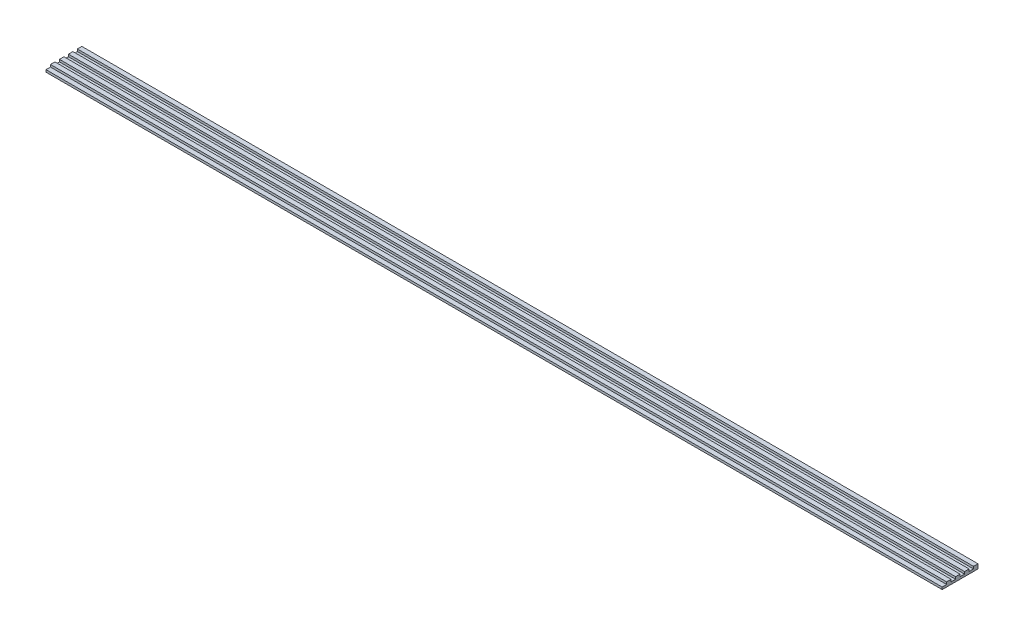
ISO-10303-21;
HEADER;
FILE_DESCRIPTION(('STEP AP214'),'2;1');
FILE_NAME('part.step','',(''),(''),'','','');
FILE_SCHEMA(('AUTOMOTIVE_DESIGN { 1 0 10303 214 1 1 1 1 }'));
ENDSEC;
DATA;
#1=APPLICATION_CONTEXT('core data for automotive mechanical design processes');
#2=APPLICATION_PROTOCOL_DEFINITION('international standard','automotive_design',2000,#1);
#3=PRODUCT_CONTEXT('',#1,'mechanical');
#4=PRODUCT('Part','Part','',(#3));
#5=PRODUCT_RELATED_PRODUCT_CATEGORY('part','',(#4));
#6=PRODUCT_DEFINITION_FORMATION('','',#4);
#7=PRODUCT_DEFINITION_CONTEXT('part definition',#1,'design');
#8=PRODUCT_DEFINITION('design','',#6,#7);
#9=PRODUCT_DEFINITION_SHAPE('','',#8);
#10=(LENGTH_UNIT() NAMED_UNIT(*) SI_UNIT(.MILLI.,.METRE.));
#11=(NAMED_UNIT(*) PLANE_ANGLE_UNIT() SI_UNIT($,.RADIAN.));
#12=(NAMED_UNIT(*) SI_UNIT($,.STERADIAN.) SOLID_ANGLE_UNIT());
#13=UNCERTAINTY_MEASURE_WITH_UNIT(LENGTH_MEASURE(1.E-05),#10,'distance_accuracy_value','');
#14=(GEOMETRIC_REPRESENTATION_CONTEXT(3) GLOBAL_UNCERTAINTY_ASSIGNED_CONTEXT((#13)) GLOBAL_UNIT_ASSIGNED_CONTEXT((#10,
#11,#12)) REPRESENTATION_CONTEXT('',''));
#15=CARTESIAN_POINT('',(0.,0.,0.));
#16=DIRECTION('',(0.,0.,1.));
#17=DIRECTION('',(1.,0.,0.));
#18=AXIS2_PLACEMENT_3D('',#15,#16,#17);
#19=CARTESIAN_POINT('',(0.,0.5,0.));
#20=DIRECTION('',(0.,1.,0.));
#21=DIRECTION('',(0.,0.,1.));
#22=AXIS2_PLACEMENT_3D('',#19,#20,#21);
#23=PLANE('',#22);
#24=DIRECTION('',(0.,0.,1.));
#25=VECTOR('',#24,1.);
#26=CARTESIAN_POINT('',(-100.,0.5,-4.));
#27=LINE('',#26,#25);
#28=CARTESIAN_POINT('',(-100.,0.5,0.999999999999999));
#29=VERTEX_POINT('',#28);
#30=CARTESIAN_POINT('',(-100.,0.5,2.));
#31=VERTEX_POINT('',#30);
#32=EDGE_CURVE('E365',#29,#31,#27,.T.);
#33=ORIENTED_EDGE('',*,*,#32,.T.);
#34=DIRECTION('',(-1.,0.,0.));
#35=VECTOR('',#34,1.);
#36=CARTESIAN_POINT('',(-99.9999999999999,0.5,2.));
#37=LINE('',#36,#35);
#38=CARTESIAN_POINT('',(100.,0.5,2.));
#39=VERTEX_POINT('',#38);
#40=EDGE_CURVE('E55',#39,#31,#37,.T.);
#41=ORIENTED_EDGE('',*,*,#40,.F.);
#42=DIRECTION('',(0.,0.,-1.));
#43=VECTOR('',#42,1.);
#44=CARTESIAN_POINT('',(100.,0.5,-4.));
#45=LINE('',#44,#43);
#46=CARTESIAN_POINT('',(100.,0.5,0.999999999999999));
#47=VERTEX_POINT('',#46);
#48=EDGE_CURVE('E302',#39,#47,#45,.T.);
#49=ORIENTED_EDGE('',*,*,#48,.T.);
#50=DIRECTION('',(1.,0.,0.));
#51=VECTOR('',#50,1.);
#52=CARTESIAN_POINT('',(-100.,0.5,0.999999999999999));
#53=LINE('',#52,#51);
#54=EDGE_CURVE('E196',#29,#47,#53,.T.);
#55=ORIENTED_EDGE('',*,*,#54,.F.);
#56=EDGE_LOOP('',(#33,#41,#49,#55));
#57=FACE_BOUND('',#56,.T.);
#58=ADVANCED_FACE('F39',(#57),#23,.T.);
#59=CARTESIAN_POINT('',(100.,0.5,4.));
#60=VERTEX_POINT('',#59);
#61=CARTESIAN_POINT('',(100.,0.5,3.));
#62=VERTEX_POINT('',#61);
#63=EDGE_CURVE('E63',#60,#62,#45,.T.);
#64=ORIENTED_EDGE('',*,*,#63,.T.);
#65=DIRECTION('',(1.,0.,0.));
#66=VECTOR('',#65,1.);
#67=CARTESIAN_POINT('',(-99.9999999999999,0.5,3.));
#68=LINE('',#67,#66);
#69=CARTESIAN_POINT('',(-99.9999999999999,0.5,3.));
#70=VERTEX_POINT('',#69);
#71=EDGE_CURVE('E187',#70,#62,#68,.T.);
#72=ORIENTED_EDGE('',*,*,#71,.F.);
#73=CARTESIAN_POINT('',(-100.,0.5,4.));
#74=VERTEX_POINT('',#73);
#75=EDGE_CURVE('E301',#70,#74,#27,.T.);
#76=ORIENTED_EDGE('',*,*,#75,.T.);
#77=DIRECTION('',(1.,0.,0.));
#78=VECTOR('',#77,1.);
#79=CARTESIAN_POINT('',(-100.,0.5,4.));
#80=LINE('',#79,#78);
#81=EDGE_CURVE('E307',#74,#60,#80,.T.);
#82=ORIENTED_EDGE('',*,*,#81,.T.);
#83=EDGE_LOOP('',(#64,#72,#76,#82));
#84=FACE_BOUND('',#83,.T.);
#85=ADVANCED_FACE('F363',(#84),#23,.T.);
#86=CARTESIAN_POINT('',(-100.,0.5,-1.));
#87=VERTEX_POINT('',#86);
#88=CARTESIAN_POINT('',(-100.,0.5,0.));
#89=VERTEX_POINT('',#88);
#90=EDGE_CURVE('E308',#87,#89,#27,.T.);
#91=ORIENTED_EDGE('',*,*,#90,.T.);
#92=DIRECTION('',(-1.,0.,0.));
#93=VECTOR('',#92,1.);
#94=CARTESIAN_POINT('',(-100.,0.5,0.));
#95=LINE('',#94,#93);
#96=CARTESIAN_POINT('',(100.,0.5,0.));
#97=VERTEX_POINT('',#96);
#98=EDGE_CURVE('E191',#97,#89,#95,.T.);
#99=ORIENTED_EDGE('',*,*,#98,.F.);
#100=CARTESIAN_POINT('',(100.,0.5,-1.));
#101=VERTEX_POINT('',#100);
#102=EDGE_CURVE('E381',#97,#101,#45,.T.);
#103=ORIENTED_EDGE('',*,*,#102,.T.);
#104=DIRECTION('',(1.,0.,0.));
#105=VECTOR('',#104,1.);
#106=CARTESIAN_POINT('',(-100.,0.5,-1.));
#107=LINE('',#106,#105);
#108=EDGE_CURVE('E240',#87,#101,#107,.T.);
#109=ORIENTED_EDGE('',*,*,#108,.F.);
#110=EDGE_LOOP('',(#91,#99,#103,#109));
#111=FACE_BOUND('',#110,.T.);
#112=ADVANCED_FACE('F371',(#111),#23,.T.);
#113=CARTESIAN_POINT('',(-100.,0.5,-3.));
#114=VERTEX_POINT('',#113);
#115=CARTESIAN_POINT('',(-100.,0.5,-2.));
#116=VERTEX_POINT('',#115);
#117=EDGE_CURVE('E304',#114,#116,#27,.T.);
#118=ORIENTED_EDGE('',*,*,#117,.T.);
#119=DIRECTION('',(-1.,0.,0.));
#120=VECTOR('',#119,1.);
#121=CARTESIAN_POINT('',(-100.,0.5,-2.));
#122=LINE('',#121,#120);
#123=CARTESIAN_POINT('',(100.,0.5,-2.));
#124=VERTEX_POINT('',#123);
#125=EDGE_CURVE('E234',#124,#116,#122,.T.);
#126=ORIENTED_EDGE('',*,*,#125,.F.);
#127=CARTESIAN_POINT('',(100.,0.5,-3.));
#128=VERTEX_POINT('',#127);
#129=EDGE_CURVE('E303',#124,#128,#45,.T.);
#130=ORIENTED_EDGE('',*,*,#129,.T.);
#131=DIRECTION('',(1.,0.,0.));
#132=VECTOR('',#131,1.);
#133=CARTESIAN_POINT('',(-100.,0.5,-3.));
#134=LINE('',#133,#132);
#135=EDGE_CURVE('E271',#114,#128,#134,.T.);
#136=ORIENTED_EDGE('',*,*,#135,.F.);
#137=EDGE_LOOP('',(#118,#126,#130,#136));
#138=FACE_BOUND('',#137,.T.);
#139=ADVANCED_FACE('F389',(#138),#23,.T.);
#140=CARTESIAN_POINT('',(100.,0.5,-4.));
#141=DIRECTION('',(-1.,0.,0.));
#142=DIRECTION('',(0.,0.,1.));
#143=AXIS2_PLACEMENT_3D('',#140,#141,#142);
#144=PLANE('',#143);
#145=DIRECTION('',(0.,0.,-1.));
#146=VECTOR('',#145,1.);
#147=CARTESIAN_POINT('',(100.,0.,-4.));
#148=LINE('',#147,#146);
#149=CARTESIAN_POINT('',(100.,0.,4.));
#150=VERTEX_POINT('',#149);
#151=CARTESIAN_POINT('',(100.,0.,-4.));
#152=VERTEX_POINT('',#151);
#153=EDGE_CURVE('E298',#150,#152,#148,.T.);
#154=ORIENTED_EDGE('',*,*,#153,.T.);
#155=DIRECTION('',(0.,-1.,0.));
#156=VECTOR('',#155,1.);
#157=CARTESIAN_POINT('',(100.,0.5,-4.));
#158=LINE('',#157,#156);
#159=CARTESIAN_POINT('',(100.,1.,-4.));
#160=VERTEX_POINT('',#159);
#161=EDGE_CURVE('E11',#160,#152,#158,.T.);
#162=ORIENTED_EDGE('',*,*,#161,.F.);
#163=DIRECTION('',(0.,0.,-1.));
#164=VECTOR('',#163,1.);
#165=CARTESIAN_POINT('',(100.,1.,-4.));
#166=LINE('',#165,#164);
#167=CARTESIAN_POINT('',(100.,1.,-3.));
#168=VERTEX_POINT('',#167);
#169=EDGE_CURVE('E279',#168,#160,#166,.T.);
#170=ORIENTED_EDGE('',*,*,#169,.F.);
#171=DIRECTION('',(0.,-1.,0.));
#172=VECTOR('',#171,1.);
#173=CARTESIAN_POINT('',(100.,1.,-3.));
#174=LINE('',#173,#172);
#175=EDGE_CURVE('E287',#168,#128,#174,.T.);
#176=ORIENTED_EDGE('',*,*,#175,.T.);
#177=ORIENTED_EDGE('',*,*,#129,.F.);
#178=DIRECTION('',(0.,-1.,0.));
#179=VECTOR('',#178,1.);
#180=CARTESIAN_POINT('',(100.,1.,-2.));
#181=LINE('',#180,#179);
#182=CARTESIAN_POINT('',(100.,1.,-2.));
#183=VERTEX_POINT('',#182);
#184=EDGE_CURVE('E249',#183,#124,#181,.T.);
#185=ORIENTED_EDGE('',*,*,#184,.F.);
#186=DIRECTION('',(0.,0.,-1.));
#187=VECTOR('',#186,1.);
#188=CARTESIAN_POINT('',(100.,1.,-2.));
#189=LINE('',#188,#187);
#190=CARTESIAN_POINT('',(100.,1.,-1.));
#191=VERTEX_POINT('',#190);
#192=EDGE_CURVE('E246',#191,#183,#189,.T.);
#193=ORIENTED_EDGE('',*,*,#192,.F.);
#194=DIRECTION('',(0.,-1.,0.));
#195=VECTOR('',#194,1.);
#196=CARTESIAN_POINT('',(100.,1.,-1.));
#197=LINE('',#196,#195);
#198=EDGE_CURVE('E259',#191,#101,#197,.T.);
#199=ORIENTED_EDGE('',*,*,#198,.T.);
#200=ORIENTED_EDGE('',*,*,#102,.F.);
#201=DIRECTION('',(0.,-1.,0.));
#202=VECTOR('',#201,1.);
#203=CARTESIAN_POINT('',(100.,1.,0.));
#204=LINE('',#203,#202);
#205=CARTESIAN_POINT('',(100.,1.,0.));
#206=VERTEX_POINT('',#205);
#207=EDGE_CURVE('E214',#206,#97,#204,.T.);
#208=ORIENTED_EDGE('',*,*,#207,.F.);
#209=DIRECTION('',(0.,0.,-1.));
#210=VECTOR('',#209,1.);
#211=CARTESIAN_POINT('',(100.,1.,0.));
#212=LINE('',#211,#210);
#213=CARTESIAN_POINT('',(100.,1.,0.999999999999999));
#214=VERTEX_POINT('',#213);
#215=EDGE_CURVE('E212',#214,#206,#212,.T.);
#216=ORIENTED_EDGE('',*,*,#215,.F.);
#217=DIRECTION('',(0.,-1.,0.));
#218=VECTOR('',#217,1.);
#219=CARTESIAN_POINT('',(100.,1.,0.999999999999999));
#220=LINE('',#219,#218);
#221=EDGE_CURVE('E222',#214,#47,#220,.T.);
#222=ORIENTED_EDGE('',*,*,#221,.T.);
#223=ORIENTED_EDGE('',*,*,#48,.F.);
#224=DIRECTION('',(0.,-1.,0.));
#225=VECTOR('',#224,1.);
#226=CARTESIAN_POINT('',(100.,1.,2.));
#227=LINE('',#226,#225);
#228=CARTESIAN_POINT('',(100.,1.,2.));
#229=VERTEX_POINT('',#228);
#230=EDGE_CURVE('E351',#229,#39,#227,.T.);
#231=ORIENTED_EDGE('',*,*,#230,.F.);
#232=DIRECTION('',(0.,0.,-1.));
#233=VECTOR('',#232,1.);
#234=CARTESIAN_POINT('',(100.,1.,2.));
#235=LINE('',#234,#233);
#236=CARTESIAN_POINT('',(100.,1.,3.));
#237=VERTEX_POINT('',#236);
#238=EDGE_CURVE('E182',#237,#229,#235,.T.);
#239=ORIENTED_EDGE('',*,*,#238,.F.);
#240=DIRECTION('',(0.,-1.,0.));
#241=VECTOR('',#240,1.);
#242=CARTESIAN_POINT('',(100.,1.,3.));
#243=LINE('',#242,#241);
#244=EDGE_CURVE('E198',#237,#62,#243,.T.);
#245=ORIENTED_EDGE('',*,*,#244,.T.);
#246=ORIENTED_EDGE('',*,*,#63,.F.);
#247=DIRECTION('',(0.,-1.,0.));
#248=VECTOR('',#247,1.);
#249=CARTESIAN_POINT('',(100.,0.5,4.));
#250=LINE('',#249,#248);
#251=EDGE_CURVE('E311',#60,#150,#250,.T.);
#252=ORIENTED_EDGE('',*,*,#251,.T.);
#253=EDGE_LOOP('',(#154,#162,#170,#176,#177,#185,#193,#199,#200,#208,#216,#222,#223,#231,#239,
#245,#246,#252));
#254=FACE_BOUND('',#253,.T.);
#255=ADVANCED_FACE('F41',(#254),#144,.F.);
#256=CARTESIAN_POINT('',(-100.,0.5,-4.));
#257=DIRECTION('',(0.,0.,1.));
#258=DIRECTION('',(1.,0.,0.));
#259=AXIS2_PLACEMENT_3D('',#256,#257,#258);
#260=PLANE('',#259);
#261=DIRECTION('',(-1.,0.,0.));
#262=VECTOR('',#261,1.);
#263=CARTESIAN_POINT('',(-100.,0.,-4.));
#264=LINE('',#263,#262);
#265=CARTESIAN_POINT('',(-100.,0.,-4.));
#266=VERTEX_POINT('',#265);
#267=EDGE_CURVE('E315',#152,#266,#264,.T.);
#268=ORIENTED_EDGE('',*,*,#267,.T.);
#269=DIRECTION('',(0.,-1.,0.));
#270=VECTOR('',#269,1.);
#271=CARTESIAN_POINT('',(-100.,0.5,-4.));
#272=LINE('',#271,#270);
#273=CARTESIAN_POINT('',(-100.,1.,-4.));
#274=VERTEX_POINT('',#273);
#275=EDGE_CURVE('E48',#274,#266,#272,.T.);
#276=ORIENTED_EDGE('',*,*,#275,.F.);
#277=DIRECTION('',(-1.,0.,0.));
#278=VECTOR('',#277,1.);
#279=CARTESIAN_POINT('',(-100.,1.,-4.));
#280=LINE('',#279,#278);
#281=EDGE_CURVE('E283',#160,#274,#280,.T.);
#282=ORIENTED_EDGE('',*,*,#281,.F.);
#283=ORIENTED_EDGE('',*,*,#161,.T.);
#284=EDGE_LOOP('',(#268,#276,#282,#283));
#285=FACE_BOUND('',#284,.T.);
#286=ADVANCED_FACE('F398',(#285),#260,.F.);
#287=CARTESIAN_POINT('',(-100.,0.5,-4.));
#288=DIRECTION('',(1.,0.,0.));
#289=DIRECTION('',(0.,0.,-1.));
#290=AXIS2_PLACEMENT_3D('',#287,#288,#289);
#291=PLANE('',#290);
#292=DIRECTION('',(0.,0.,1.));
#293=VECTOR('',#292,1.);
#294=CARTESIAN_POINT('',(-100.,0.,-4.));
#295=LINE('',#294,#293);
#296=CARTESIAN_POINT('',(-100.,0.,4.));
#297=VERTEX_POINT('',#296);
#298=EDGE_CURVE('E318',#266,#297,#295,.T.);
#299=ORIENTED_EDGE('',*,*,#298,.T.);
#300=DIRECTION('',(0.,-1.,0.));
#301=VECTOR('',#300,1.);
#302=CARTESIAN_POINT('',(-100.,0.5,4.));
#303=LINE('',#302,#301);
#304=EDGE_CURVE('E327',#74,#297,#303,.T.);
#305=ORIENTED_EDGE('',*,*,#304,.F.);
#306=ORIENTED_EDGE('',*,*,#75,.F.);
#307=DIRECTION('',(0.,-1.,0.));
#308=VECTOR('',#307,1.);
#309=CARTESIAN_POINT('',(-99.9999999999999,1.,3.));
#310=LINE('',#309,#308);
#311=CARTESIAN_POINT('',(-99.9999999999999,1.,3.));
#312=VERTEX_POINT('',#311);
#313=EDGE_CURVE('E172',#312,#70,#310,.T.);
#314=ORIENTED_EDGE('',*,*,#313,.F.);
#315=DIRECTION('',(0.,0.,1.));
#316=VECTOR('',#315,1.);
#317=CARTESIAN_POINT('',(-99.9999999999999,1.,2.));
#318=LINE('',#317,#316);
#319=CARTESIAN_POINT('',(-99.9999999999999,1.,2.));
#320=VERTEX_POINT('',#319);
#321=EDGE_CURVE('E166',#320,#312,#318,.T.);
#322=ORIENTED_EDGE('',*,*,#321,.F.);
#323=DIRECTION('',(0.,-1.,0.));
#324=VECTOR('',#323,1.);
#325=CARTESIAN_POINT('',(-99.9999999999999,1.,2.));
#326=LINE('',#325,#324);
#327=EDGE_CURVE('E170',#320,#31,#326,.T.);
#328=ORIENTED_EDGE('',*,*,#327,.T.);
#329=ORIENTED_EDGE('',*,*,#32,.F.);
#330=DIRECTION('',(0.,-1.,0.));
#331=VECTOR('',#330,1.);
#332=CARTESIAN_POINT('',(-100.,1.,0.999999999999999));
#333=LINE('',#332,#331);
#334=CARTESIAN_POINT('',(-100.,1.,0.999999999999999));
#335=VERTEX_POINT('',#334);
#336=EDGE_CURVE('E226',#335,#29,#333,.T.);
#337=ORIENTED_EDGE('',*,*,#336,.F.);
#338=DIRECTION('',(0.,0.,1.));
#339=VECTOR('',#338,1.);
#340=CARTESIAN_POINT('',(-100.,1.,0.));
#341=LINE('',#340,#339);
#342=CARTESIAN_POINT('',(-100.,1.,0.));
#343=VERTEX_POINT('',#342);
#344=EDGE_CURVE('E206',#343,#335,#341,.T.);
#345=ORIENTED_EDGE('',*,*,#344,.F.);
#346=DIRECTION('',(0.,-1.,0.));
#347=VECTOR('',#346,1.);
#348=CARTESIAN_POINT('',(-100.,1.,0.));
#349=LINE('',#348,#347);
#350=EDGE_CURVE('E230',#343,#89,#349,.T.);
#351=ORIENTED_EDGE('',*,*,#350,.T.);
#352=ORIENTED_EDGE('',*,*,#90,.F.);
#353=DIRECTION('',(0.,-1.,0.));
#354=VECTOR('',#353,1.);
#355=CARTESIAN_POINT('',(-100.,1.,-1.));
#356=LINE('',#355,#354);
#357=CARTESIAN_POINT('',(-100.,1.,-1.));
#358=VERTEX_POINT('',#357);
#359=EDGE_CURVE('E263',#358,#87,#356,.T.);
#360=ORIENTED_EDGE('',*,*,#359,.F.);
#361=DIRECTION('',(0.,0.,1.));
#362=VECTOR('',#361,1.);
#363=CARTESIAN_POINT('',(-100.,1.,-2.));
#364=LINE('',#363,#362);
#365=CARTESIAN_POINT('',(-100.,1.,-2.));
#366=VERTEX_POINT('',#365);
#367=EDGE_CURVE('E239',#366,#358,#364,.T.);
#368=ORIENTED_EDGE('',*,*,#367,.F.);
#369=DIRECTION('',(0.,-1.,0.));
#370=VECTOR('',#369,1.);
#371=CARTESIAN_POINT('',(-100.,1.,-2.));
#372=LINE('',#371,#370);
#373=EDGE_CURVE('E267',#366,#116,#372,.T.);
#374=ORIENTED_EDGE('',*,*,#373,.T.);
#375=ORIENTED_EDGE('',*,*,#117,.F.);
#376=DIRECTION('',(0.,-1.,0.));
#377=VECTOR('',#376,1.);
#378=CARTESIAN_POINT('',(-100.,1.,-3.));
#379=LINE('',#378,#377);
#380=CARTESIAN_POINT('',(-100.,1.,-3.));
#381=VERTEX_POINT('',#380);
#382=EDGE_CURVE('E294',#381,#114,#379,.T.);
#383=ORIENTED_EDGE('',*,*,#382,.F.);
#384=DIRECTION('',(0.,0.,1.));
#385=VECTOR('',#384,1.);
#386=CARTESIAN_POINT('',(-100.,1.,-4.));
#387=LINE('',#386,#385);
#388=EDGE_CURVE('E272',#274,#381,#387,.T.);
#389=ORIENTED_EDGE('',*,*,#388,.F.);
#390=ORIENTED_EDGE('',*,*,#275,.T.);
#391=EDGE_LOOP('',(#299,#305,#306,#314,#322,#328,#329,#337,#345,#351,#352,#360,#368,#374,#375,
#383,#389,#390));
#392=FACE_BOUND('',#391,.T.);
#393=ADVANCED_FACE('F168',(#392),#291,.F.);
#394=CARTESIAN_POINT('',(-100.,0.5,4.));
#395=DIRECTION('',(0.,0.,-1.));
#396=DIRECTION('',(-1.,0.,0.));
#397=AXIS2_PLACEMENT_3D('',#394,#395,#396);
#398=PLANE('',#397);
#399=DIRECTION('',(1.,0.,0.));
#400=VECTOR('',#399,1.);
#401=CARTESIAN_POINT('',(-100.,0.,4.));
#402=LINE('',#401,#400);
#403=EDGE_CURVE('E321',#297,#150,#402,.T.);
#404=ORIENTED_EDGE('',*,*,#403,.T.);
#405=ORIENTED_EDGE('',*,*,#251,.F.);
#406=ORIENTED_EDGE('',*,*,#81,.F.);
#407=ORIENTED_EDGE('',*,*,#304,.T.);
#408=EDGE_LOOP('',(#404,#405,#406,#407));
#409=FACE_BOUND('',#408,.T.);
#410=ADVANCED_FACE('F344',(#409),#398,.F.);
#411=CARTESIAN_POINT('',(0.,0.,0.));
#412=DIRECTION('',(0.,1.,0.));
#413=DIRECTION('',(0.,0.,1.));
#414=AXIS2_PLACEMENT_3D('',#411,#412,#413);
#415=PLANE('',#414);
#416=ORIENTED_EDGE('',*,*,#153,.F.);
#417=ORIENTED_EDGE('',*,*,#403,.F.);
#418=ORIENTED_EDGE('',*,*,#298,.F.);
#419=ORIENTED_EDGE('',*,*,#267,.F.);
#420=EDGE_LOOP('',(#416,#417,#418,#419));
#421=FACE_BOUND('',#420,.T.);
#422=ADVANCED_FACE('F341',(#421),#415,.F.);
#423=CARTESIAN_POINT('',(-100.,1.,-3.));
#424=DIRECTION('',(0.,0.,-1.));
#425=DIRECTION('',(-1.,0.,0.));
#426=AXIS2_PLACEMENT_3D('',#423,#424,#425);
#427=PLANE('',#426);
#428=ORIENTED_EDGE('',*,*,#135,.T.);
#429=ORIENTED_EDGE('',*,*,#175,.F.);
#430=DIRECTION('',(1.,0.,0.));
#431=VECTOR('',#430,1.);
#432=CARTESIAN_POINT('',(-100.,1.,-3.));
#433=LINE('',#432,#431);
#434=EDGE_CURVE('E276',#381,#168,#433,.T.);
#435=ORIENTED_EDGE('',*,*,#434,.F.);
#436=ORIENTED_EDGE('',*,*,#382,.T.);
#437=EDGE_LOOP('',(#428,#429,#435,#436));
#438=FACE_BOUND('',#437,.T.);
#439=ADVANCED_FACE('F394',(#438),#427,.F.);
#440=CARTESIAN_POINT('',(0.,1.,0.));
#441=DIRECTION('',(0.,1.,0.));
#442=DIRECTION('',(0.,0.,1.));
#443=AXIS2_PLACEMENT_3D('',#440,#441,#442);
#444=PLANE('',#443);
#445=ORIENTED_EDGE('',*,*,#388,.T.);
#446=ORIENTED_EDGE('',*,*,#434,.T.);
#447=ORIENTED_EDGE('',*,*,#169,.T.);
#448=ORIENTED_EDGE('',*,*,#281,.T.);
#449=EDGE_LOOP('',(#445,#446,#447,#448));
#450=FACE_BOUND('',#449,.T.);
#451=ADVANCED_FACE('F397',(#450),#444,.T.);
#452=CARTESIAN_POINT('',(-100.,1.,-2.));
#453=DIRECTION('',(0.,0.,1.));
#454=DIRECTION('',(1.,0.,0.));
#455=AXIS2_PLACEMENT_3D('',#452,#453,#454);
#456=PLANE('',#455);
#457=ORIENTED_EDGE('',*,*,#125,.T.);
#458=ORIENTED_EDGE('',*,*,#373,.F.);
#459=DIRECTION('',(-1.,0.,0.));
#460=VECTOR('',#459,1.);
#461=CARTESIAN_POINT('',(-100.,1.,-2.));
#462=LINE('',#461,#460);
#463=EDGE_CURVE('E235',#183,#366,#462,.T.);
#464=ORIENTED_EDGE('',*,*,#463,.F.);
#465=ORIENTED_EDGE('',*,*,#184,.T.);
#466=EDGE_LOOP('',(#457,#458,#464,#465));
#467=FACE_BOUND('',#466,.T.);
#468=ADVANCED_FACE('F470',(#467),#456,.F.);
#469=CARTESIAN_POINT('',(-100.,1.,-1.));
#470=DIRECTION('',(0.,0.,-1.));
#471=DIRECTION('',(-1.,0.,0.));
#472=AXIS2_PLACEMENT_3D('',#469,#470,#471);
#473=PLANE('',#472);
#474=ORIENTED_EDGE('',*,*,#108,.T.);
#475=ORIENTED_EDGE('',*,*,#198,.F.);
#476=DIRECTION('',(1.,0.,0.));
#477=VECTOR('',#476,1.);
#478=CARTESIAN_POINT('',(-100.,1.,-1.));
#479=LINE('',#478,#477);
#480=EDGE_CURVE('E243',#358,#191,#479,.T.);
#481=ORIENTED_EDGE('',*,*,#480,.F.);
#482=ORIENTED_EDGE('',*,*,#359,.T.);
#483=EDGE_LOOP('',(#474,#475,#481,#482));
#484=FACE_BOUND('',#483,.T.);
#485=ADVANCED_FACE('F479',(#484),#473,.F.);
#486=CARTESIAN_POINT('',(0.,1.,0.));
#487=DIRECTION('',(0.,-1.,0.));
#488=DIRECTION('',(0.,0.,-1.));
#489=AXIS2_PLACEMENT_3D('',#486,#487,#488);
#490=PLANE('',#489);
#491=ORIENTED_EDGE('',*,*,#463,.T.);
#492=ORIENTED_EDGE('',*,*,#367,.T.);
#493=ORIENTED_EDGE('',*,*,#480,.T.);
#494=ORIENTED_EDGE('',*,*,#192,.T.);
#495=EDGE_LOOP('',(#491,#492,#493,#494));
#496=FACE_BOUND('',#495,.T.);
#497=ADVANCED_FACE('F489',(#496),#490,.F.);
#498=CARTESIAN_POINT('',(-100.,1.,0.));
#499=DIRECTION('',(0.,0.,1.));
#500=DIRECTION('',(1.,0.,0.));
#501=AXIS2_PLACEMENT_3D('',#498,#499,#500);
#502=PLANE('',#501);
#503=ORIENTED_EDGE('',*,*,#98,.T.);
#504=ORIENTED_EDGE('',*,*,#350,.F.);
#505=DIRECTION('',(-1.,0.,0.));
#506=VECTOR('',#505,1.);
#507=CARTESIAN_POINT('',(-100.,1.,0.));
#508=LINE('',#507,#506);
#509=EDGE_CURVE('E202',#206,#343,#508,.T.);
#510=ORIENTED_EDGE('',*,*,#509,.F.);
#511=ORIENTED_EDGE('',*,*,#207,.T.);
#512=EDGE_LOOP('',(#503,#504,#510,#511));
#513=FACE_BOUND('',#512,.T.);
#514=ADVANCED_FACE('F378',(#513),#502,.F.);
#515=CARTESIAN_POINT('',(-100.,1.,0.999999999999999));
#516=DIRECTION('',(0.,0.,-1.));
#517=DIRECTION('',(-1.,0.,0.));
#518=AXIS2_PLACEMENT_3D('',#515,#516,#517);
#519=PLANE('',#518);
#520=ORIENTED_EDGE('',*,*,#54,.T.);
#521=ORIENTED_EDGE('',*,*,#221,.F.);
#522=DIRECTION('',(1.,0.,0.));
#523=VECTOR('',#522,1.);
#524=CARTESIAN_POINT('',(-100.,1.,0.999999999999999));
#525=LINE('',#524,#523);
#526=EDGE_CURVE('E209',#335,#214,#525,.T.);
#527=ORIENTED_EDGE('',*,*,#526,.F.);
#528=ORIENTED_EDGE('',*,*,#336,.T.);
#529=EDGE_LOOP('',(#520,#521,#527,#528));
#530=FACE_BOUND('',#529,.T.);
#531=ADVANCED_FACE('F508',(#530),#519,.F.);
#532=CARTESIAN_POINT('',(0.,1.,0.));
#533=DIRECTION('',(0.,-1.,0.));
#534=DIRECTION('',(0.,0.,-1.));
#535=AXIS2_PLACEMENT_3D('',#532,#533,#534);
#536=PLANE('',#535);
#537=ORIENTED_EDGE('',*,*,#509,.T.);
#538=ORIENTED_EDGE('',*,*,#344,.T.);
#539=ORIENTED_EDGE('',*,*,#526,.T.);
#540=ORIENTED_EDGE('',*,*,#215,.T.);
#541=EDGE_LOOP('',(#537,#538,#539,#540));
#542=FACE_BOUND('',#541,.T.);
#543=ADVANCED_FACE('F517',(#542),#536,.F.);
#544=CARTESIAN_POINT('',(-99.9999999999999,1.,2.));
#545=DIRECTION('',(0.,0.,1.));
#546=DIRECTION('',(1.,0.,0.));
#547=AXIS2_PLACEMENT_3D('',#544,#545,#546);
#548=PLANE('',#547);
#549=ORIENTED_EDGE('',*,*,#40,.T.);
#550=ORIENTED_EDGE('',*,*,#327,.F.);
#551=DIRECTION('',(-1.,0.,0.));
#552=VECTOR('',#551,1.);
#553=CARTESIAN_POINT('',(-99.9999999999999,1.,2.));
#554=LINE('',#553,#552);
#555=EDGE_CURVE('E177',#229,#320,#554,.T.);
#556=ORIENTED_EDGE('',*,*,#555,.F.);
#557=ORIENTED_EDGE('',*,*,#230,.T.);
#558=EDGE_LOOP('',(#549,#550,#556,#557));
#559=FACE_BOUND('',#558,.T.);
#560=ADVANCED_FACE('F189',(#559),#548,.F.);
#561=CARTESIAN_POINT('',(-99.9999999999999,1.,3.));
#562=DIRECTION('',(0.,0.,-1.));
#563=DIRECTION('',(-1.,0.,0.));
#564=AXIS2_PLACEMENT_3D('',#561,#562,#563);
#565=PLANE('',#564);
#566=ORIENTED_EDGE('',*,*,#71,.T.);
#567=ORIENTED_EDGE('',*,*,#244,.F.);
#568=DIRECTION('',(1.,0.,0.));
#569=VECTOR('',#568,1.);
#570=CARTESIAN_POINT('',(-99.9999999999999,1.,3.));
#571=LINE('',#570,#569);
#572=EDGE_CURVE('E176',#312,#237,#571,.T.);
#573=ORIENTED_EDGE('',*,*,#572,.F.);
#574=ORIENTED_EDGE('',*,*,#313,.T.);
#575=EDGE_LOOP('',(#566,#567,#573,#574));
#576=FACE_BOUND('',#575,.T.);
#577=ADVANCED_FACE('F362',(#576),#565,.F.);
#578=CARTESIAN_POINT('',(0.,1.,0.));
#579=DIRECTION('',(0.,-1.,0.));
#580=DIRECTION('',(0.,0.,-1.));
#581=AXIS2_PLACEMENT_3D('',#578,#579,#580);
#582=PLANE('',#581);
#583=ORIENTED_EDGE('',*,*,#555,.T.);
#584=ORIENTED_EDGE('',*,*,#321,.T.);
#585=ORIENTED_EDGE('',*,*,#572,.T.);
#586=ORIENTED_EDGE('',*,*,#238,.T.);
#587=EDGE_LOOP('',(#583,#584,#585,#586));
#588=FACE_BOUND('',#587,.T.);
#589=ADVANCED_FACE('F180',(#588),#582,.F.);
#590=CLOSED_SHELL('',(#58,#85,#112,#139,#255,#286,#393,#410,#422,#439,#451,#468,#485,#497,#514,
#531,#543,#560,#577,#589));
#591=MANIFOLD_SOLID_BREP('B2',#590);
#592=ADVANCED_BREP_SHAPE_REPRESENTATION('',(#18,#591),#14);
#593=SHAPE_DEFINITION_REPRESENTATION(#9,#592);
ENDSEC;
END-ISO-10303-21;
